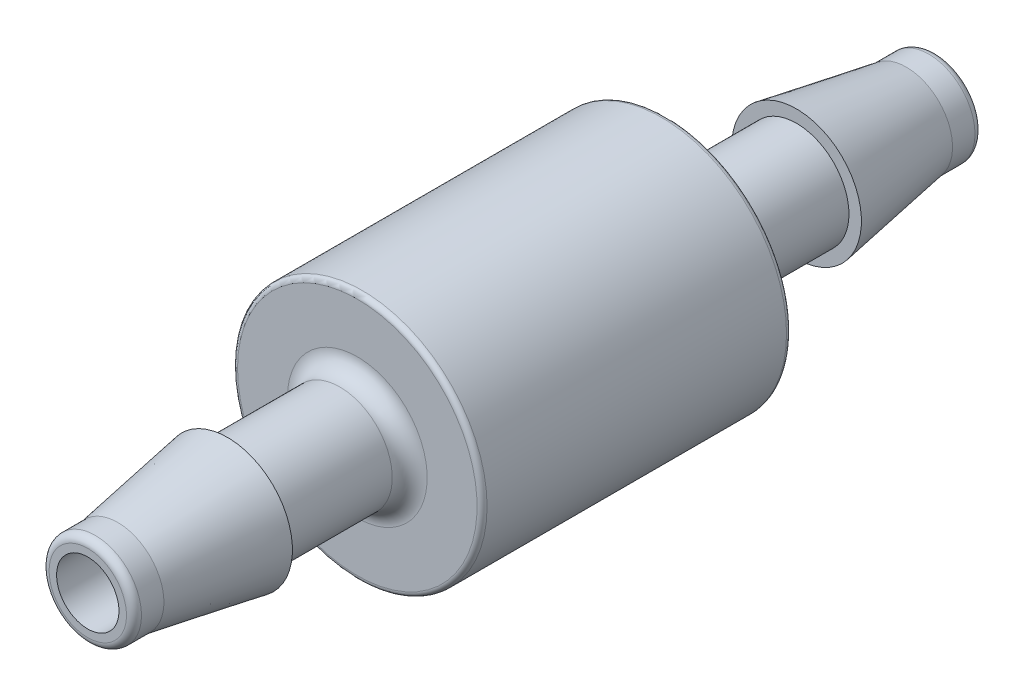
ISO-10303-21;
HEADER;
FILE_DESCRIPTION(('STEP AP214'),'2;1');
FILE_NAME('part.step','',(''),(''),'','','');
FILE_SCHEMA(('AUTOMOTIVE_DESIGN { 1 0 10303 214 1 1 1 1 }'));
ENDSEC;
DATA;
#1=APPLICATION_CONTEXT('core data for automotive mechanical design processes');
#2=APPLICATION_PROTOCOL_DEFINITION('international standard','automotive_design',2000,#1);
#3=PRODUCT_CONTEXT('',#1,'mechanical');
#4=PRODUCT('Part','Part','',(#3));
#5=PRODUCT_RELATED_PRODUCT_CATEGORY('part','',(#4));
#6=PRODUCT_DEFINITION_FORMATION('','',#4);
#7=PRODUCT_DEFINITION_CONTEXT('part definition',#1,'design');
#8=PRODUCT_DEFINITION('design','',#6,#7);
#9=PRODUCT_DEFINITION_SHAPE('','',#8);
#10=(LENGTH_UNIT() NAMED_UNIT(*) SI_UNIT(.MILLI.,.METRE.));
#11=(NAMED_UNIT(*) PLANE_ANGLE_UNIT() SI_UNIT($,.RADIAN.));
#12=(NAMED_UNIT(*) SI_UNIT($,.STERADIAN.) SOLID_ANGLE_UNIT());
#13=UNCERTAINTY_MEASURE_WITH_UNIT(LENGTH_MEASURE(1.E-05),#10,'distance_accuracy_value','');
#14=(GEOMETRIC_REPRESENTATION_CONTEXT(3) GLOBAL_UNCERTAINTY_ASSIGNED_CONTEXT((#13)) GLOBAL_UNIT_ASSIGNED_CONTEXT((#10,
#11,#12)) REPRESENTATION_CONTEXT('',''));
#15=CARTESIAN_POINT('',(0.,0.,0.));
#16=DIRECTION('',(0.,0.,1.));
#17=DIRECTION('',(1.,0.,0.));
#18=AXIS2_PLACEMENT_3D('',#15,#16,#17);
#19=CARTESIAN_POINT('',(0.,-3.302,14.478));
#20=DIRECTION('',(0.,0.,-1.));
#21=DIRECTION('',(-1.,0.,0.));
#22=AXIS2_PLACEMENT_3D('',#19,#20,#21);
#23=PLANE('',#22);
#24=CARTESIAN_POINT('',(0.,0.,14.478));
#25=DIRECTION('',(0.,0.,-1.));
#26=DIRECTION('',(-1.,0.,0.));
#27=AXIS2_PLACEMENT_3D('',#24,#25,#26);
#28=CIRCLE('',#27,3.30199999999999);
#29=CARTESIAN_POINT('',(-3.30199999999999,0.,14.478));
#30=VERTEX_POINT('',#29);
#31=EDGE_CURVE('E10',#30,#30,#28,.T.);
#32=ORIENTED_EDGE('',*,*,#31,.T.);
#33=EDGE_LOOP('',(#32));
#34=FACE_BOUND('',#33,.T.);
#35=CARTESIAN_POINT('',(0.,0.,14.478));
#36=DIRECTION('',(0.,0.,-1.));
#37=DIRECTION('',(-1.,0.,0.));
#38=AXIS2_PLACEMENT_3D('',#35,#36,#37);
#39=CIRCLE('',#38,2.66699999999999);
#40=CARTESIAN_POINT('',(-2.66699999999999,0.,14.478));
#41=VERTEX_POINT('',#40);
#42=EDGE_CURVE('E99',#41,#41,#39,.T.);
#43=ORIENTED_EDGE('',*,*,#42,.F.);
#44=EDGE_LOOP('',(#43));
#45=FACE_BOUND('',#44,.T.);
#46=ADVANCED_FACE('F35',(#34,#45),#23,.T.);
#47=CARTESIAN_POINT('',(0.,0.,14.478));
#48=DIRECTION('',(0.,0.,-1.));
#49=DIRECTION('',(-1.,0.,0.));
#50=AXIS2_PLACEMENT_3D('',#47,#48,#49);
#51=CONICAL_SURFACE('',#50,3.30199999999999,0.168831902011121);
#52=CARTESIAN_POINT('',(0.,0.,20.066));
#53=DIRECTION('',(0.,0.,-1.));
#54=DIRECTION('',(-1.,0.,0.));
#55=AXIS2_PLACEMENT_3D('',#52,#53,#54);
#56=CIRCLE('',#55,2.34949999999999);
#57=CARTESIAN_POINT('',(-2.34949999999999,0.,20.066));
#58=VERTEX_POINT('',#57);
#59=EDGE_CURVE('E41',#58,#58,#56,.T.);
#60=ORIENTED_EDGE('',*,*,#59,.T.);
#61=EDGE_LOOP('',(#60));
#62=FACE_BOUND('',#61,.T.);
#63=ORIENTED_EDGE('',*,*,#31,.F.);
#64=EDGE_LOOP('',(#63));
#65=FACE_BOUND('',#64,.T.);
#66=ADVANCED_FACE('F107',(#62,#65),#51,.T.);
#67=CARTESIAN_POINT('',(0.,0.,-21.59));
#68=DIRECTION('',(0.,0.,-1.));
#69=DIRECTION('',(-1.,0.,0.));
#70=AXIS2_PLACEMENT_3D('',#67,#68,#69);
#71=CYLINDRICAL_SURFACE('',#70,2.34949999999999);
#72=CARTESIAN_POINT('',(0.,0.,21.209));
#73=DIRECTION('',(0.,0.,-1.));
#74=DIRECTION('',(-1.,0.,0.));
#75=AXIS2_PLACEMENT_3D('',#72,#73,#74);
#76=CIRCLE('',#75,2.34949999999999);
#77=CARTESIAN_POINT('',(-2.34949999999999,0.,21.209));
#78=VERTEX_POINT('',#77);
#79=EDGE_CURVE('E45',#78,#78,#76,.T.);
#80=ORIENTED_EDGE('',*,*,#79,.T.);
#81=EDGE_LOOP('',(#80));
#82=FACE_BOUND('',#81,.T.);
#83=ORIENTED_EDGE('',*,*,#59,.F.);
#84=EDGE_LOOP('',(#83));
#85=FACE_BOUND('',#84,.T.);
#86=ADVANCED_FACE('F111',(#82,#85),#71,.T.);
#87=CARTESIAN_POINT('',(0.,0.,21.209));
#88=DIRECTION('',(0.,0.,-1.));
#89=DIRECTION('',(-1.,0.,0.));
#90=AXIS2_PLACEMENT_3D('',#87,#88,#89);
#91=TOROIDAL_SURFACE('',#90,1.96849999999999,0.381);
#92=CARTESIAN_POINT('',(0.,0.,21.59));
#93=DIRECTION('',(0.,0.,-1.));
#94=DIRECTION('',(-1.,0.,0.));
#95=AXIS2_PLACEMENT_3D('',#92,#93,#94);
#96=CIRCLE('',#95,1.96849999999999);
#97=CARTESIAN_POINT('',(-1.96849999999999,0.,21.59));
#98=VERTEX_POINT('',#97);
#99=EDGE_CURVE('E49',#98,#98,#96,.T.);
#100=ORIENTED_EDGE('',*,*,#99,.T.);
#101=EDGE_LOOP('',(#100));
#102=FACE_BOUND('',#101,.T.);
#103=ORIENTED_EDGE('',*,*,#79,.F.);
#104=EDGE_LOOP('',(#103));
#105=FACE_BOUND('',#104,.T.);
#106=ADVANCED_FACE('F115',(#102,#105),#91,.T.);
#107=CARTESIAN_POINT('',(0.,-1.5875,21.59));
#108=DIRECTION('',(0.,0.,1.));
#109=DIRECTION('',(1.,0.,0.));
#110=AXIS2_PLACEMENT_3D('',#107,#108,#109);
#111=PLANE('',#110);
#112=CARTESIAN_POINT('',(0.,0.,21.59));
#113=DIRECTION('',(0.,0.,-1.));
#114=DIRECTION('',(-1.,0.,0.));
#115=AXIS2_PLACEMENT_3D('',#112,#113,#114);
#116=CIRCLE('',#115,1.5875);
#117=CARTESIAN_POINT('',(-1.5875,0.,21.59));
#118=VERTEX_POINT('',#117);
#119=EDGE_CURVE('E54',#118,#118,#116,.T.);
#120=ORIENTED_EDGE('',*,*,#119,.T.);
#121=EDGE_LOOP('',(#120));
#122=FACE_BOUND('',#121,.T.);
#123=ORIENTED_EDGE('',*,*,#99,.F.);
#124=EDGE_LOOP('',(#123));
#125=FACE_BOUND('',#124,.T.);
#126=ADVANCED_FACE('F122',(#122,#125),#111,.T.);
#127=CARTESIAN_POINT('',(0.,0.,-21.59));
#128=DIRECTION('',(0.,0.,-1.));
#129=DIRECTION('',(-1.,0.,0.));
#130=AXIS2_PLACEMENT_3D('',#127,#128,#129);
#131=CYLINDRICAL_SURFACE('',#130,1.5875);
#132=CARTESIAN_POINT('',(0.,0.,-21.59));
#133=DIRECTION('',(0.,0.,-1.));
#134=DIRECTION('',(-1.,0.,0.));
#135=AXIS2_PLACEMENT_3D('',#132,#133,#134);
#136=CIRCLE('',#135,1.5875);
#137=CARTESIAN_POINT('',(-1.5875,0.,-21.59));
#138=VERTEX_POINT('',#137);
#139=EDGE_CURVE('E57',#138,#138,#136,.T.);
#140=ORIENTED_EDGE('',*,*,#139,.T.);
#141=EDGE_LOOP('',(#140));
#142=FACE_BOUND('',#141,.T.);
#143=ORIENTED_EDGE('',*,*,#119,.F.);
#144=EDGE_LOOP('',(#143));
#145=FACE_BOUND('',#144,.T.);
#146=ADVANCED_FACE('F126',(#142,#145),#131,.F.);
#147=CARTESIAN_POINT('',(0.,-1.5875,-21.59));
#148=DIRECTION('',(0.,0.,-1.));
#149=DIRECTION('',(-1.,0.,0.));
#150=AXIS2_PLACEMENT_3D('',#147,#148,#149);
#151=PLANE('',#150);
#152=CARTESIAN_POINT('',(0.,0.,-21.59));
#153=DIRECTION('',(0.,0.,-1.));
#154=DIRECTION('',(-1.,0.,0.));
#155=AXIS2_PLACEMENT_3D('',#152,#153,#154);
#156=CIRCLE('',#155,1.96849999999999);
#157=CARTESIAN_POINT('',(-1.96849999999999,0.,-21.59));
#158=VERTEX_POINT('',#157);
#159=EDGE_CURVE('E60',#158,#158,#156,.T.);
#160=ORIENTED_EDGE('',*,*,#159,.T.);
#161=EDGE_LOOP('',(#160));
#162=FACE_BOUND('',#161,.T.);
#163=ORIENTED_EDGE('',*,*,#139,.F.);
#164=EDGE_LOOP('',(#163));
#165=FACE_BOUND('',#164,.T.);
#166=ADVANCED_FACE('F130',(#162,#165),#151,.T.);
#167=CARTESIAN_POINT('',(0.,0.,-21.209));
#168=DIRECTION('',(0.,0.,-1.));
#169=DIRECTION('',(-1.,0.,0.));
#170=AXIS2_PLACEMENT_3D('',#167,#168,#169);
#171=TOROIDAL_SURFACE('',#170,1.96849999999999,0.381);
#172=CARTESIAN_POINT('',(0.,0.,-21.209));
#173=DIRECTION('',(0.,0.,-1.));
#174=DIRECTION('',(-1.,0.,0.));
#175=AXIS2_PLACEMENT_3D('',#172,#173,#174);
#176=CIRCLE('',#175,2.34949999999999);
#177=CARTESIAN_POINT('',(-2.34949999999999,0.,-21.209));
#178=VERTEX_POINT('',#177);
#179=EDGE_CURVE('E63',#178,#178,#176,.T.);
#180=ORIENTED_EDGE('',*,*,#179,.T.);
#181=EDGE_LOOP('',(#180));
#182=FACE_BOUND('',#181,.T.);
#183=ORIENTED_EDGE('',*,*,#159,.F.);
#184=EDGE_LOOP('',(#183));
#185=FACE_BOUND('',#184,.T.);
#186=ADVANCED_FACE('F134',(#182,#185),#171,.T.);
#187=CARTESIAN_POINT('',(0.,0.,-21.59));
#188=DIRECTION('',(0.,0.,-1.));
#189=DIRECTION('',(-1.,0.,0.));
#190=AXIS2_PLACEMENT_3D('',#187,#188,#189);
#191=CYLINDRICAL_SURFACE('',#190,2.34949999999999);
#192=CARTESIAN_POINT('',(0.,0.,-20.066));
#193=DIRECTION('',(0.,0.,-1.));
#194=DIRECTION('',(-1.,0.,0.));
#195=AXIS2_PLACEMENT_3D('',#192,#193,#194);
#196=CIRCLE('',#195,2.34949999999999);
#197=CARTESIAN_POINT('',(-2.34949999999999,0.,-20.066));
#198=VERTEX_POINT('',#197);
#199=EDGE_CURVE('E66',#198,#198,#196,.T.);
#200=ORIENTED_EDGE('',*,*,#199,.T.);
#201=EDGE_LOOP('',(#200));
#202=FACE_BOUND('',#201,.T.);
#203=ORIENTED_EDGE('',*,*,#179,.F.);
#204=EDGE_LOOP('',(#203));
#205=FACE_BOUND('',#204,.T.);
#206=ADVANCED_FACE('F138',(#202,#205),#191,.T.);
#207=CARTESIAN_POINT('',(0.,0.,-20.066));
#208=DIRECTION('',(0.,0.,1.));
#209=DIRECTION('',(1.,0.,0.));
#210=AXIS2_PLACEMENT_3D('',#207,#208,#209);
#211=CONICAL_SURFACE('',#210,2.34949999999999,0.168831902011121);
#212=CARTESIAN_POINT('',(0.,0.,-14.478));
#213=DIRECTION('',(0.,0.,-1.));
#214=DIRECTION('',(-1.,0.,0.));
#215=AXIS2_PLACEMENT_3D('',#212,#213,#214);
#216=CIRCLE('',#215,3.30199999999999);
#217=CARTESIAN_POINT('',(-3.30199999999999,0.,-14.478));
#218=VERTEX_POINT('',#217);
#219=EDGE_CURVE('E69',#218,#218,#216,.T.);
#220=ORIENTED_EDGE('',*,*,#219,.T.);
#221=EDGE_LOOP('',(#220));
#222=FACE_BOUND('',#221,.T.);
#223=ORIENTED_EDGE('',*,*,#199,.F.);
#224=EDGE_LOOP('',(#223));
#225=FACE_BOUND('',#224,.T.);
#226=ADVANCED_FACE('F142',(#222,#225),#211,.T.);
#227=CARTESIAN_POINT('',(0.,-3.302,-14.478));
#228=DIRECTION('',(0.,0.,1.));
#229=DIRECTION('',(1.,0.,0.));
#230=AXIS2_PLACEMENT_3D('',#227,#228,#229);
#231=PLANE('',#230);
#232=CARTESIAN_POINT('',(0.,0.,-14.478));
#233=DIRECTION('',(0.,0.,-1.));
#234=DIRECTION('',(-1.,0.,0.));
#235=AXIS2_PLACEMENT_3D('',#232,#233,#234);
#236=CIRCLE('',#235,2.66699999999999);
#237=CARTESIAN_POINT('',(-2.66699999999999,0.,-14.478));
#238=VERTEX_POINT('',#237);
#239=EDGE_CURVE('E72',#238,#238,#236,.T.);
#240=ORIENTED_EDGE('',*,*,#239,.T.);
#241=EDGE_LOOP('',(#240));
#242=FACE_BOUND('',#241,.T.);
#243=ORIENTED_EDGE('',*,*,#219,.F.);
#244=EDGE_LOOP('',(#243));
#245=FACE_BOUND('',#244,.T.);
#246=ADVANCED_FACE('F146',(#242,#245),#231,.T.);
#247=CARTESIAN_POINT('',(0.,0.,-21.59));
#248=DIRECTION('',(0.,0.,-1.));
#249=DIRECTION('',(-1.,0.,0.));
#250=AXIS2_PLACEMENT_3D('',#247,#248,#249);
#251=CYLINDRICAL_SURFACE('',#250,2.66699999999999);
#252=CARTESIAN_POINT('',(0.,0.,-8.76300000000001));
#253=DIRECTION('',(0.,0.,-1.));
#254=DIRECTION('',(-1.,0.,0.));
#255=AXIS2_PLACEMENT_3D('',#252,#253,#254);
#256=CIRCLE('',#255,2.66699999999999);
#257=CARTESIAN_POINT('',(-2.66699999999999,0.,-8.76300000000001));
#258=VERTEX_POINT('',#257);
#259=EDGE_CURVE('E75',#258,#258,#256,.T.);
#260=ORIENTED_EDGE('',*,*,#259,.T.);
#261=EDGE_LOOP('',(#260));
#262=FACE_BOUND('',#261,.T.);
#263=ORIENTED_EDGE('',*,*,#239,.F.);
#264=EDGE_LOOP('',(#263));
#265=FACE_BOUND('',#264,.T.);
#266=ADVANCED_FACE('F150',(#262,#265),#251,.T.);
#267=CARTESIAN_POINT('',(0.,0.,-8.76300000000001));
#268=DIRECTION('',(0.,0.,-1.));
#269=DIRECTION('',(-1.,0.,0.));
#270=AXIS2_PLACEMENT_3D('',#267,#268,#269);
#271=TOROIDAL_SURFACE('',#270,3.55599999999999,0.889);
#272=CARTESIAN_POINT('',(0.,0.,-7.87400000000001));
#273=DIRECTION('',(0.,0.,-1.));
#274=DIRECTION('',(-1.,0.,0.));
#275=AXIS2_PLACEMENT_3D('',#272,#273,#274);
#276=CIRCLE('',#275,3.55599999999999);
#277=CARTESIAN_POINT('',(-3.55599999999999,0.,-7.87400000000001));
#278=VERTEX_POINT('',#277);
#279=EDGE_CURVE('E78',#278,#278,#276,.T.);
#280=ORIENTED_EDGE('',*,*,#279,.T.);
#281=EDGE_LOOP('',(#280));
#282=FACE_BOUND('',#281,.T.);
#283=ORIENTED_EDGE('',*,*,#259,.F.);
#284=EDGE_LOOP('',(#283));
#285=FACE_BOUND('',#284,.T.);
#286=ADVANCED_FACE('F154',(#282,#285),#271,.F.);
#287=CARTESIAN_POINT('',(0.,-3.556,-7.87400000000001));
#288=DIRECTION('',(0.,0.,-1.));
#289=DIRECTION('',(-1.,0.,0.));
#290=AXIS2_PLACEMENT_3D('',#287,#288,#289);
#291=PLANE('',#290);
#292=CARTESIAN_POINT('',(0.,0.,-7.87400000000001));
#293=DIRECTION('',(0.,0.,-1.));
#294=DIRECTION('',(-1.,0.,0.));
#295=AXIS2_PLACEMENT_3D('',#292,#293,#294);
#296=CIRCLE('',#295,6.096);
#297=CARTESIAN_POINT('',(-6.096,0.,-7.87400000000001));
#298=VERTEX_POINT('',#297);
#299=EDGE_CURVE('E81',#298,#298,#296,.T.);
#300=ORIENTED_EDGE('',*,*,#299,.T.);
#301=EDGE_LOOP('',(#300));
#302=FACE_BOUND('',#301,.T.);
#303=ORIENTED_EDGE('',*,*,#279,.F.);
#304=EDGE_LOOP('',(#303));
#305=FACE_BOUND('',#304,.T.);
#306=ADVANCED_FACE('F158',(#302,#305),#291,.T.);
#307=CARTESIAN_POINT('',(0.,0.,-7.62000000000001));
#308=DIRECTION('',(0.,0.,-1.));
#309=DIRECTION('',(-1.,0.,0.));
#310=AXIS2_PLACEMENT_3D('',#307,#308,#309);
#311=TOROIDAL_SURFACE('',#310,6.096,0.253999999999999);
#312=CARTESIAN_POINT('',(0.,0.,-7.62000000000001));
#313=DIRECTION('',(0.,0.,-1.));
#314=DIRECTION('',(-1.,0.,0.));
#315=AXIS2_PLACEMENT_3D('',#312,#313,#314);
#316=CIRCLE('',#315,6.35);
#317=CARTESIAN_POINT('',(-6.35,0.,-7.62000000000001));
#318=VERTEX_POINT('',#317);
#319=EDGE_CURVE('E84',#318,#318,#316,.T.);
#320=ORIENTED_EDGE('',*,*,#319,.T.);
#321=EDGE_LOOP('',(#320));
#322=FACE_BOUND('',#321,.T.);
#323=ORIENTED_EDGE('',*,*,#299,.F.);
#324=EDGE_LOOP('',(#323));
#325=FACE_BOUND('',#324,.T.);
#326=ADVANCED_FACE('F162',(#322,#325),#311,.T.);
#327=CARTESIAN_POINT('',(0.,0.,-21.59));
#328=DIRECTION('',(0.,0.,-1.));
#329=DIRECTION('',(-1.,0.,0.));
#330=AXIS2_PLACEMENT_3D('',#327,#328,#329);
#331=CYLINDRICAL_SURFACE('',#330,6.34999999999999);
#332=CARTESIAN_POINT('',(0.,0.,7.62));
#333=DIRECTION('',(0.,0.,-1.));
#334=DIRECTION('',(-1.,0.,0.));
#335=AXIS2_PLACEMENT_3D('',#332,#333,#334);
#336=CIRCLE('',#335,6.34999999999999);
#337=CARTESIAN_POINT('',(-6.34999999999999,0.,7.62));
#338=VERTEX_POINT('',#337);
#339=EDGE_CURVE('E87',#338,#338,#336,.T.);
#340=ORIENTED_EDGE('',*,*,#339,.T.);
#341=EDGE_LOOP('',(#340));
#342=FACE_BOUND('',#341,.T.);
#343=ORIENTED_EDGE('',*,*,#319,.F.);
#344=EDGE_LOOP('',(#343));
#345=FACE_BOUND('',#344,.T.);
#346=ADVANCED_FACE('F166',(#342,#345),#331,.T.);
#347=CARTESIAN_POINT('',(0.,0.,7.62));
#348=DIRECTION('',(0.,0.,-1.));
#349=DIRECTION('',(-1.,0.,0.));
#350=AXIS2_PLACEMENT_3D('',#347,#348,#349);
#351=TOROIDAL_SURFACE('',#350,6.096,0.253999999999999);
#352=CARTESIAN_POINT('',(0.,0.,7.874));
#353=DIRECTION('',(0.,0.,-1.));
#354=DIRECTION('',(-1.,0.,0.));
#355=AXIS2_PLACEMENT_3D('',#352,#353,#354);
#356=CIRCLE('',#355,6.096);
#357=CARTESIAN_POINT('',(-6.096,0.,7.874));
#358=VERTEX_POINT('',#357);
#359=EDGE_CURVE('E90',#358,#358,#356,.T.);
#360=ORIENTED_EDGE('',*,*,#359,.T.);
#361=EDGE_LOOP('',(#360));
#362=FACE_BOUND('',#361,.T.);
#363=ORIENTED_EDGE('',*,*,#339,.F.);
#364=EDGE_LOOP('',(#363));
#365=FACE_BOUND('',#364,.T.);
#366=ADVANCED_FACE('F170',(#362,#365),#351,.T.);
#367=CARTESIAN_POINT('',(0.,-3.556,7.874));
#368=DIRECTION('',(0.,0.,1.));
#369=DIRECTION('',(1.,0.,0.));
#370=AXIS2_PLACEMENT_3D('',#367,#368,#369);
#371=PLANE('',#370);
#372=CARTESIAN_POINT('',(0.,0.,7.874));
#373=DIRECTION('',(0.,0.,-1.));
#374=DIRECTION('',(-1.,0.,0.));
#375=AXIS2_PLACEMENT_3D('',#372,#373,#374);
#376=CIRCLE('',#375,3.55599999999999);
#377=CARTESIAN_POINT('',(-3.55599999999999,0.,7.874));
#378=VERTEX_POINT('',#377);
#379=EDGE_CURVE('E93',#378,#378,#376,.T.);
#380=ORIENTED_EDGE('',*,*,#379,.T.);
#381=EDGE_LOOP('',(#380));
#382=FACE_BOUND('',#381,.T.);
#383=ORIENTED_EDGE('',*,*,#359,.F.);
#384=EDGE_LOOP('',(#383));
#385=FACE_BOUND('',#384,.T.);
#386=ADVANCED_FACE('F174',(#382,#385),#371,.T.);
#387=CARTESIAN_POINT('',(0.,0.,8.763));
#388=DIRECTION('',(0.,0.,-1.));
#389=DIRECTION('',(-1.,0.,0.));
#390=AXIS2_PLACEMENT_3D('',#387,#388,#389);
#391=TOROIDAL_SURFACE('',#390,3.55599999999999,0.889);
#392=CARTESIAN_POINT('',(0.,0.,8.763));
#393=DIRECTION('',(0.,0.,-1.));
#394=DIRECTION('',(-1.,0.,0.));
#395=AXIS2_PLACEMENT_3D('',#392,#393,#394);
#396=CIRCLE('',#395,2.66699999999999);
#397=CARTESIAN_POINT('',(-2.66699999999999,0.,8.763));
#398=VERTEX_POINT('',#397);
#399=EDGE_CURVE('E96',#398,#398,#396,.T.);
#400=ORIENTED_EDGE('',*,*,#399,.T.);
#401=EDGE_LOOP('',(#400));
#402=FACE_BOUND('',#401,.T.);
#403=ORIENTED_EDGE('',*,*,#379,.F.);
#404=EDGE_LOOP('',(#403));
#405=FACE_BOUND('',#404,.T.);
#406=ADVANCED_FACE('F178',(#402,#405),#391,.F.);
#407=CARTESIAN_POINT('',(0.,0.,-21.59));
#408=DIRECTION('',(0.,0.,-1.));
#409=DIRECTION('',(-1.,0.,0.));
#410=AXIS2_PLACEMENT_3D('',#407,#408,#409);
#411=CYLINDRICAL_SURFACE('',#410,2.66699999999999);
#412=ORIENTED_EDGE('',*,*,#42,.T.);
#413=EDGE_LOOP('',(#412));
#414=FACE_BOUND('',#413,.T.);
#415=ORIENTED_EDGE('',*,*,#399,.F.);
#416=EDGE_LOOP('',(#415));
#417=FACE_BOUND('',#416,.T.);
#418=ADVANCED_FACE('F103',(#414,#417),#411,.T.);
#419=CLOSED_SHELL('',(#46,#66,#86,#106,#126,#146,#166,#186,#206,#226,#246,#266,#286,#306,#326,
#346,#366,#386,#406,#418));
#420=MANIFOLD_SOLID_BREP('B2',#419);
#421=ADVANCED_BREP_SHAPE_REPRESENTATION('',(#18,#420),#14);
#422=SHAPE_DEFINITION_REPRESENTATION(#9,#421);
ENDSEC;
END-ISO-10303-21;
